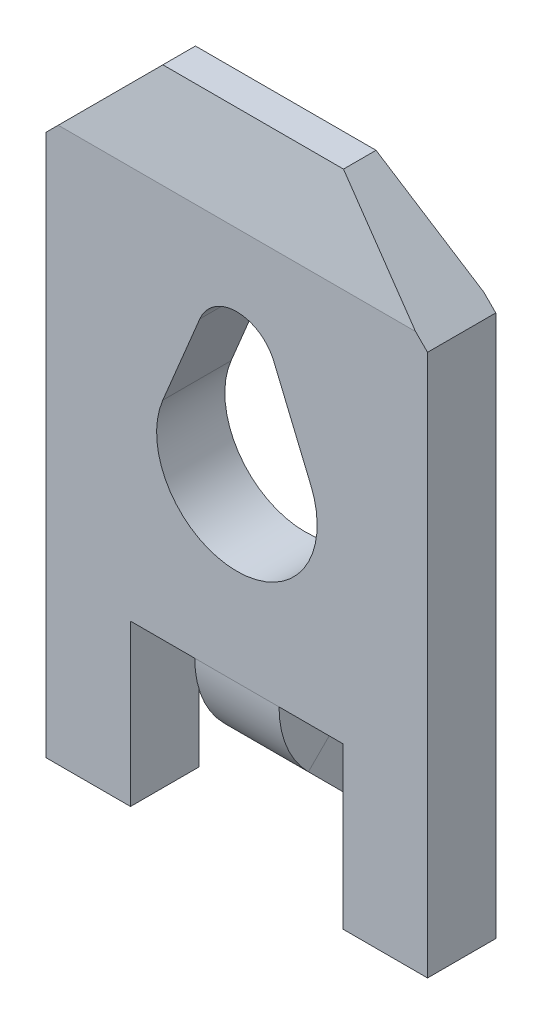
ISO-10303-21;
HEADER;
FILE_DESCRIPTION(('STEP AP214'),'2;1');
FILE_NAME('part.step','',(''),(''),'','','');
FILE_SCHEMA(('AUTOMOTIVE_DESIGN { 1 0 10303 214 1 1 1 1 }'));
ENDSEC;
DATA;
#1=APPLICATION_CONTEXT('core data for automotive mechanical design processes');
#2=APPLICATION_PROTOCOL_DEFINITION('international standard','automotive_design',2000,#1);
#3=PRODUCT_CONTEXT('',#1,'mechanical');
#4=PRODUCT('Part','Part','',(#3));
#5=PRODUCT_RELATED_PRODUCT_CATEGORY('part','',(#4));
#6=PRODUCT_DEFINITION_FORMATION('','',#4);
#7=PRODUCT_DEFINITION_CONTEXT('part definition',#1,'design');
#8=PRODUCT_DEFINITION('design','',#6,#7);
#9=PRODUCT_DEFINITION_SHAPE('','',#8);
#10=(LENGTH_UNIT() NAMED_UNIT(*) SI_UNIT(.MILLI.,.METRE.));
#11=(NAMED_UNIT(*) PLANE_ANGLE_UNIT() SI_UNIT($,.RADIAN.));
#12=(NAMED_UNIT(*) SI_UNIT($,.STERADIAN.) SOLID_ANGLE_UNIT());
#13=UNCERTAINTY_MEASURE_WITH_UNIT(LENGTH_MEASURE(1.E-05),#10,'distance_accuracy_value','');
#14=(GEOMETRIC_REPRESENTATION_CONTEXT(3) GLOBAL_UNCERTAINTY_ASSIGNED_CONTEXT((#13)) GLOBAL_UNIT_ASSIGNED_CONTEXT((#10,
#11,#12)) REPRESENTATION_CONTEXT('',''));
#15=CARTESIAN_POINT('',(0.,0.,0.));
#16=DIRECTION('',(0.,0.,1.));
#17=DIRECTION('',(1.,0.,0.));
#18=AXIS2_PLACEMENT_3D('',#15,#16,#17);
#19=CARTESIAN_POINT('',(4.75,0.149999999999999,0.));
#20=DIRECTION('',(0.,0.,1.));
#21=DIRECTION('',(0.,-1.,0.));
#22=AXIS2_PLACEMENT_3D('',#19,#20,#21);
#23=PLANE('',#22);
#24=DIRECTION('',(0.384813689288076,-0.922994271128754,0.));
#25=VECTOR('',#24,1.);
#26=CARTESIAN_POINT('',(2.84243697464802,5.82748992853653,0.));
#27=LINE('',#26,#25);
#28=CARTESIAN_POINT('',(2.84243697464802,5.82748992853653,0.));
#29=VERTEX_POINT('',#28);
#30=CARTESIAN_POINT('',(3.29799427112875,4.73481368928808,0.));
#31=VERTEX_POINT('',#30);
#32=EDGE_CURVE('E271',#29,#31,#27,.T.);
#33=ORIENTED_EDGE('',*,*,#32,.F.);
#34=CARTESIAN_POINT('',(2.375,5.65,0.));
#35=DIRECTION('',(0.,0.,1.));
#36=DIRECTION('',(0.,-1.,0.));
#37=AXIS2_PLACEMENT_3D('',#34,#35,#36);
#38=CIRCLE('',#37,0.5);
#39=CARTESIAN_POINT('',(1.91346153846154,5.84230769230769,0.));
#40=VERTEX_POINT('',#39);
#41=EDGE_CURVE('E274',#40,#29,#38,.F.);
#42=ORIENTED_EDGE('',*,*,#41,.F.);
#43=DIRECTION('',(0.384615384615385,0.923076923076923,0.));
#44=VECTOR('',#43,1.);
#45=CARTESIAN_POINT('',(1.91346153846154,5.84230769230769,0.));
#46=LINE('',#45,#44);
#47=CARTESIAN_POINT('',(1.45192307692308,4.73461538461538,0.));
#48=VERTEX_POINT('',#47);
#49=EDGE_CURVE('E276',#48,#40,#46,.T.);
#50=ORIENTED_EDGE('',*,*,#49,.F.);
#51=CARTESIAN_POINT('',(2.375,4.35,0.));
#52=DIRECTION('',(0.,0.,1.));
#53=DIRECTION('',(0.,-1.,0.));
#54=AXIS2_PLACEMENT_3D('',#51,#52,#53);
#55=CIRCLE('',#54,1.);
#56=EDGE_CURVE('E268',#31,#48,#55,.F.);
#57=ORIENTED_EDGE('',*,*,#56,.F.);
#58=EDGE_LOOP('',(#33,#42,#50,#57));
#59=FACE_BOUND('',#58,.T.);
#60=DIRECTION('',(1.,0.,0.));
#61=VECTOR('',#60,1.);
#62=CARTESIAN_POINT('',(2.9,2.15,0.));
#63=LINE('',#62,#61);
#64=CARTESIAN_POINT('',(2.9,2.15,0.));
#65=VERTEX_POINT('',#64);
#66=CARTESIAN_POINT('',(3.7,2.15,0.));
#67=VERTEX_POINT('',#66);
#68=EDGE_CURVE('E236',#65,#67,#63,.T.);
#69=ORIENTED_EDGE('',*,*,#68,.F.);
#70=DIRECTION('',(-1.,0.,0.));
#71=VECTOR('',#70,1.);
#72=CARTESIAN_POINT('',(4.75,2.15,0.));
#73=LINE('',#72,#71);
#74=CARTESIAN_POINT('',(1.85,2.15,0.));
#75=VERTEX_POINT('',#74);
#76=EDGE_CURVE('E49',#65,#75,#73,.T.);
#77=ORIENTED_EDGE('',*,*,#76,.T.);
#78=DIRECTION('',(1.,0.,0.));
#79=VECTOR('',#78,1.);
#80=CARTESIAN_POINT('',(1.85,2.15,0.));
#81=LINE('',#80,#79);
#82=CARTESIAN_POINT('',(1.05,2.15,0.));
#83=VERTEX_POINT('',#82);
#84=EDGE_CURVE('E247',#83,#75,#81,.T.);
#85=ORIENTED_EDGE('',*,*,#84,.F.);
#86=DIRECTION('',(0.,1.,0.));
#87=VECTOR('',#86,1.);
#88=CARTESIAN_POINT('',(1.05,2.15,0.));
#89=LINE('',#88,#87);
#90=CARTESIAN_POINT('',(1.05,0.149999999999999,0.));
#91=VERTEX_POINT('',#90);
#92=EDGE_CURVE('E245',#91,#83,#89,.T.);
#93=ORIENTED_EDGE('',*,*,#92,.F.);
#94=DIRECTION('',(-1.,0.,0.));
#95=VECTOR('',#94,1.);
#96=CARTESIAN_POINT('',(4.75,0.149999999999999,0.));
#97=LINE('',#96,#95);
#98=CARTESIAN_POINT('',(0.,0.149999999999999,0.));
#99=VERTEX_POINT('',#98);
#100=EDGE_CURVE('E345',#91,#99,#97,.T.);
#101=ORIENTED_EDGE('',*,*,#100,.T.);
#102=DIRECTION('',(0.,1.,0.));
#103=VECTOR('',#102,1.);
#104=CARTESIAN_POINT('',(0.,0.149999999999999,0.));
#105=LINE('',#104,#103);
#106=CARTESIAN_POINT('',(0.,6.9,0.));
#107=VERTEX_POINT('',#106);
#108=EDGE_CURVE('E330',#99,#107,#105,.T.);
#109=ORIENTED_EDGE('',*,*,#108,.T.);
#110=DIRECTION('',(-0.707106781186548,-0.707106781186548,0.));
#111=VECTOR('',#110,1.);
#112=CARTESIAN_POINT('',(0.,6.9,0.));
#113=LINE('',#112,#111);
#114=CARTESIAN_POINT('',(0.15,7.05,0.));
#115=VERTEX_POINT('',#114);
#116=EDGE_CURVE('E304',#115,#107,#113,.T.);
#117=ORIENTED_EDGE('',*,*,#116,.F.);
#118=DIRECTION('',(-1.,0.,0.));
#119=VECTOR('',#118,1.);
#120=CARTESIAN_POINT('',(4.75,7.05,0.));
#121=LINE('',#120,#119);
#122=CARTESIAN_POINT('',(4.6,7.05,0.));
#123=VERTEX_POINT('',#122);
#124=EDGE_CURVE('E335',#123,#115,#121,.T.);
#125=ORIENTED_EDGE('',*,*,#124,.F.);
#126=DIRECTION('',(-0.707106781186548,0.707106781186548,0.));
#127=VECTOR('',#126,1.);
#128=CARTESIAN_POINT('',(3.5,8.15,0.));
#129=LINE('',#128,#127);
#130=CARTESIAN_POINT('',(4.75,6.9,0.));
#131=VERTEX_POINT('',#130);
#132=EDGE_CURVE('E300',#131,#123,#129,.T.);
#133=ORIENTED_EDGE('',*,*,#132,.F.);
#134=DIRECTION('',(0.,1.,0.));
#135=VECTOR('',#134,1.);
#136=CARTESIAN_POINT('',(4.75,0.149999999999999,0.));
#137=LINE('',#136,#135);
#138=CARTESIAN_POINT('',(4.75,0.149999999999999,0.));
#139=VERTEX_POINT('',#138);
#140=EDGE_CURVE('E332',#139,#131,#137,.T.);
#141=ORIENTED_EDGE('',*,*,#140,.F.);
#142=CARTESIAN_POINT('',(3.7,0.149999999999999,0.));
#143=VERTEX_POINT('',#142);
#144=EDGE_CURVE('E346',#139,#143,#97,.T.);
#145=ORIENTED_EDGE('',*,*,#144,.T.);
#146=DIRECTION('',(0.,-1.,0.));
#147=VECTOR('',#146,1.);
#148=CARTESIAN_POINT('',(3.7,2.15,0.));
#149=LINE('',#148,#147);
#150=EDGE_CURVE('E260',#67,#143,#149,.T.);
#151=ORIENTED_EDGE('',*,*,#150,.F.);
#152=EDGE_LOOP('',(#69,#77,#85,#93,#101,#109,#117,#125,#133,#141,#145,#151));
#153=FACE_BOUND('',#152,.T.);
#154=ADVANCED_FACE('F42',(#59,#153),#23,.F.);
#155=CARTESIAN_POINT('',(4.75,7.05,0.85));
#156=DIRECTION('',(0.,0.,-1.));
#157=DIRECTION('',(0.,1.,0.));
#158=AXIS2_PLACEMENT_3D('',#155,#156,#157);
#159=PLANE('',#158);
#160=DIRECTION('',(-0.384615384615385,-0.923076923076923,0.));
#161=VECTOR('',#160,1.);
#162=CARTESIAN_POINT('',(1.91346153846154,5.84230769230769,0.849999999999999));
#163=LINE('',#162,#161);
#164=CARTESIAN_POINT('',(1.91346153846154,5.84230769230769,0.85));
#165=VERTEX_POINT('',#164);
#166=CARTESIAN_POINT('',(1.45192307692308,4.73461538461538,0.849999999999999));
#167=VERTEX_POINT('',#166);
#168=EDGE_CURVE('E278',#165,#167,#163,.T.);
#169=ORIENTED_EDGE('',*,*,#168,.F.);
#170=CARTESIAN_POINT('',(2.375,5.65,0.849999999999999));
#171=DIRECTION('',(0.,0.,1.));
#172=DIRECTION('',(1.,0.,0.));
#173=AXIS2_PLACEMENT_3D('',#170,#171,#172);
#174=CIRCLE('',#173,0.5);
#175=CARTESIAN_POINT('',(2.84243697464802,5.82748992853653,0.849999999999999));
#176=VERTEX_POINT('',#175);
#177=EDGE_CURVE('E254',#176,#165,#174,.T.);
#178=ORIENTED_EDGE('',*,*,#177,.F.);
#179=DIRECTION('',(-0.384813689288076,0.922994271128754,0.));
#180=VECTOR('',#179,1.);
#181=CARTESIAN_POINT('',(2.84243697464802,5.82748992853653,0.849999999999999));
#182=LINE('',#181,#180);
#183=CARTESIAN_POINT('',(3.29799427112875,4.73481368928808,0.849999999999999));
#184=VERTEX_POINT('',#183);
#185=EDGE_CURVE('E284',#184,#176,#182,.T.);
#186=ORIENTED_EDGE('',*,*,#185,.F.);
#187=CARTESIAN_POINT('',(2.375,4.35,0.849999999999999));
#188=DIRECTION('',(0.,0.,1.));
#189=DIRECTION('',(1.,0.,0.));
#190=AXIS2_PLACEMENT_3D('',#187,#188,#189);
#191=CIRCLE('',#190,1.);
#192=EDGE_CURVE('E281',#167,#184,#191,.T.);
#193=ORIENTED_EDGE('',*,*,#192,.F.);
#194=EDGE_LOOP('',(#169,#178,#186,#193));
#195=FACE_BOUND('',#194,.T.);
#196=DIRECTION('',(-1.,0.,0.));
#197=VECTOR('',#196,1.);
#198=CARTESIAN_POINT('',(1.85,2.15,0.85));
#199=LINE('',#198,#197);
#200=CARTESIAN_POINT('',(1.85,2.15,0.85));
#201=VERTEX_POINT('',#200);
#202=CARTESIAN_POINT('',(1.05,2.15,0.85));
#203=VERTEX_POINT('',#202);
#204=EDGE_CURVE('E241',#201,#203,#199,.T.);
#205=ORIENTED_EDGE('',*,*,#204,.F.);
#206=DIRECTION('',(1.,0.,0.));
#207=VECTOR('',#206,1.);
#208=CARTESIAN_POINT('',(4.75,2.15,0.849999999999999));
#209=LINE('',#208,#207);
#210=CARTESIAN_POINT('',(2.9,2.15,0.849999999999999));
#211=VERTEX_POINT('',#210);
#212=EDGE_CURVE('E362',#201,#211,#209,.T.);
#213=ORIENTED_EDGE('',*,*,#212,.T.);
#214=DIRECTION('',(-1.,0.,0.));
#215=VECTOR('',#214,1.);
#216=CARTESIAN_POINT('',(2.9,2.15,0.85));
#217=LINE('',#216,#215);
#218=CARTESIAN_POINT('',(3.7,2.15,0.85));
#219=VERTEX_POINT('',#218);
#220=EDGE_CURVE('E248',#219,#211,#217,.T.);
#221=ORIENTED_EDGE('',*,*,#220,.F.);
#222=DIRECTION('',(0.,1.,0.));
#223=VECTOR('',#222,1.);
#224=CARTESIAN_POINT('',(3.7,2.15,0.85));
#225=LINE('',#224,#223);
#226=CARTESIAN_POINT('',(3.7,0.149999999999999,0.849999999999999));
#227=VERTEX_POINT('',#226);
#228=EDGE_CURVE('E255',#227,#219,#225,.T.);
#229=ORIENTED_EDGE('',*,*,#228,.F.);
#230=DIRECTION('',(-1.,0.,0.));
#231=VECTOR('',#230,1.);
#232=CARTESIAN_POINT('',(4.75,0.149999999999999,0.849999999999999));
#233=LINE('',#232,#231);
#234=CARTESIAN_POINT('',(4.75,0.149999999999999,0.849999999999999));
#235=VERTEX_POINT('',#234);
#236=EDGE_CURVE('E350',#235,#227,#233,.T.);
#237=ORIENTED_EDGE('',*,*,#236,.F.);
#238=DIRECTION('',(0.,-1.,0.));
#239=VECTOR('',#238,1.);
#240=CARTESIAN_POINT('',(4.75,7.05,0.85));
#241=LINE('',#240,#239);
#242=CARTESIAN_POINT('',(4.75,6.9,0.85));
#243=VERTEX_POINT('',#242);
#244=EDGE_CURVE('E327',#243,#235,#241,.T.);
#245=ORIENTED_EDGE('',*,*,#244,.F.);
#246=DIRECTION('',(0.707106781186548,-0.707106781186548,0.));
#247=VECTOR('',#246,1.);
#248=CARTESIAN_POINT('',(3.5,8.15,0.849999999999999));
#249=LINE('',#248,#247);
#250=CARTESIAN_POINT('',(4.6,7.05,0.849999999999999));
#251=VERTEX_POINT('',#250);
#252=EDGE_CURVE('E296',#251,#243,#249,.T.);
#253=ORIENTED_EDGE('',*,*,#252,.F.);
#254=DIRECTION('',(-1.,0.,0.));
#255=VECTOR('',#254,1.);
#256=CARTESIAN_POINT('',(4.75,7.05,0.85));
#257=LINE('',#256,#255);
#258=CARTESIAN_POINT('',(0.15,7.05,0.849999999999999));
#259=VERTEX_POINT('',#258);
#260=EDGE_CURVE('E353',#251,#259,#257,.T.);
#261=ORIENTED_EDGE('',*,*,#260,.T.);
#262=DIRECTION('',(0.707106781186547,0.707106781186548,0.));
#263=VECTOR('',#262,1.);
#264=CARTESIAN_POINT('',(0.,6.9,0.849999999999999));
#265=LINE('',#264,#263);
#266=CARTESIAN_POINT('',(0.,6.9,0.849999999999999));
#267=VERTEX_POINT('',#266);
#268=EDGE_CURVE('E297',#267,#259,#265,.T.);
#269=ORIENTED_EDGE('',*,*,#268,.F.);
#270=DIRECTION('',(0.,-1.,0.));
#271=VECTOR('',#270,1.);
#272=CARTESIAN_POINT('',(0.,7.05,0.85));
#273=LINE('',#272,#271);
#274=CARTESIAN_POINT('',(0.,0.149999999999999,0.849999999999999));
#275=VERTEX_POINT('',#274);
#276=EDGE_CURVE('E326',#267,#275,#273,.T.);
#277=ORIENTED_EDGE('',*,*,#276,.T.);
#278=CARTESIAN_POINT('',(1.05,0.149999999999999,0.849999999999999));
#279=VERTEX_POINT('',#278);
#280=EDGE_CURVE('E349',#279,#275,#233,.T.);
#281=ORIENTED_EDGE('',*,*,#280,.F.);
#282=DIRECTION('',(0.,-1.,0.));
#283=VECTOR('',#282,1.);
#284=CARTESIAN_POINT('',(1.05,2.15,0.85));
#285=LINE('',#284,#283);
#286=EDGE_CURVE('E243',#203,#279,#285,.T.);
#287=ORIENTED_EDGE('',*,*,#286,.F.);
#288=EDGE_LOOP('',(#205,#213,#221,#229,#237,#245,#253,#261,#269,#277,#281,#287));
#289=FACE_BOUND('',#288,.T.);
#290=ADVANCED_FACE('F382',(#195,#289),#159,.F.);
#291=CARTESIAN_POINT('',(4.75,0.149999999999999,0.));
#292=DIRECTION('',(0.,1.,0.));
#293=DIRECTION('',(0.,0.,1.));
#294=AXIS2_PLACEMENT_3D('',#291,#292,#293);
#295=PLANE('',#294);
#296=ORIENTED_EDGE('',*,*,#100,.F.);
#297=DIRECTION('',(0.,0.,-1.));
#298=VECTOR('',#297,1.);
#299=CARTESIAN_POINT('',(1.05,0.149999999999999,3.0040659228538));
#300=LINE('',#299,#298);
#301=EDGE_CURVE('E63',#279,#91,#300,.T.);
#302=ORIENTED_EDGE('',*,*,#301,.F.);
#303=ORIENTED_EDGE('',*,*,#280,.T.);
#304=DIRECTION('',(0.,0.,-1.));
#305=VECTOR('',#304,1.);
#306=CARTESIAN_POINT('',(0.,0.149999999999999,0.));
#307=LINE('',#306,#305);
#308=EDGE_CURVE('E338',#275,#99,#307,.T.);
#309=ORIENTED_EDGE('',*,*,#308,.T.);
#310=EDGE_LOOP('',(#296,#302,#303,#309));
#311=FACE_BOUND('',#310,.T.);
#312=ADVANCED_FACE('F417',(#311),#295,.F.);
#313=CARTESIAN_POINT('',(4.75,7.05,0.));
#314=DIRECTION('',(0.,-0.214348018272916,0.976757353216485));
#315=DIRECTION('',(0.,-0.976757353216485,-0.214348018272916));
#316=AXIS2_PLACEMENT_3D('',#313,#314,#315);
#317=PLANE('',#316);
#318=ORIENTED_EDGE('',*,*,#124,.T.);
#319=DIRECTION('',(0.698744344369524,0.698744344369524,0.153338457091523));
#320=VECTOR('',#319,1.);
#321=CARTESIAN_POINT('',(2.39592083042662,9.29592083042662,0.492864146468432));
#322=LINE('',#321,#320);
#323=CARTESIAN_POINT('',(1.25,8.15,0.241393442622949));
#324=VERTEX_POINT('',#323);
#325=EDGE_CURVE('E317',#115,#324,#322,.T.);
#326=ORIENTED_EDGE('',*,*,#325,.T.);
#327=DIRECTION('',(-1.,0.,0.));
#328=VECTOR('',#327,1.);
#329=CARTESIAN_POINT('',(4.75,8.15,0.241393442622949));
#330=LINE('',#329,#328);
#331=CARTESIAN_POINT('',(3.5,8.15,0.241393442622949));
#332=VERTEX_POINT('',#331);
#333=EDGE_CURVE('E359',#332,#324,#330,.T.);
#334=ORIENTED_EDGE('',*,*,#333,.F.);
#335=DIRECTION('',(0.698744344369524,-0.698744344369524,-0.153338457091523));
#336=VECTOR('',#335,1.);
#337=CARTESIAN_POINT('',(4.67323654881826,6.97676345118174,-0.0160716569500576));
#338=LINE('',#337,#336);
#339=EDGE_CURVE('E323',#332,#123,#338,.T.);
#340=ORIENTED_EDGE('',*,*,#339,.T.);
#341=EDGE_LOOP('',(#318,#326,#334,#340));
#342=FACE_BOUND('',#341,.T.);
#343=ADVANCED_FACE('F479',(#342),#317,.F.);
#344=CARTESIAN_POINT('',(4.75,8.15,0.241393442622949));
#345=DIRECTION('',(0.,-1.,0.));
#346=DIRECTION('',(0.,0.,-1.));
#347=AXIS2_PLACEMENT_3D('',#344,#345,#346);
#348=PLANE('',#347);
#349=ORIENTED_EDGE('',*,*,#333,.T.);
#350=DIRECTION('',(0.,0.,1.));
#351=VECTOR('',#350,1.);
#352=CARTESIAN_POINT('',(1.25,8.15,-1.76776695296637));
#353=LINE('',#352,#351);
#354=CARTESIAN_POINT('',(1.25,8.15,0.647131147540979));
#355=VERTEX_POINT('',#354);
#356=EDGE_CURVE('E301',#324,#355,#353,.T.);
#357=ORIENTED_EDGE('',*,*,#356,.T.);
#358=DIRECTION('',(-1.,0.,0.));
#359=VECTOR('',#358,1.);
#360=CARTESIAN_POINT('',(4.75,8.15,0.647131147540979));
#361=LINE('',#360,#359);
#362=CARTESIAN_POINT('',(3.5,8.15,0.647131147540979));
#363=VERTEX_POINT('',#362);
#364=EDGE_CURVE('E356',#363,#355,#361,.T.);
#365=ORIENTED_EDGE('',*,*,#364,.F.);
#366=DIRECTION('',(0.,0.,1.));
#367=VECTOR('',#366,1.);
#368=CARTESIAN_POINT('',(3.5,8.15,-1.76776695296637));
#369=LINE('',#368,#367);
#370=EDGE_CURVE('E309',#332,#363,#369,.T.);
#371=ORIENTED_EDGE('',*,*,#370,.F.);
#372=EDGE_LOOP('',(#349,#357,#365,#371));
#373=FACE_BOUND('',#372,.T.);
#374=ADVANCED_FACE('F475',(#373),#348,.F.);
#375=CARTESIAN_POINT('',(4.75,8.15,0.647131147540979));
#376=DIRECTION('',(0.,-0.181367589437408,-0.983415373838371));
#377=DIRECTION('',(0.,0.983415373838371,-0.181367589437408));
#378=AXIS2_PLACEMENT_3D('',#375,#376,#377);
#379=PLANE('',#378);
#380=ORIENTED_EDGE('',*,*,#364,.T.);
#381=DIRECTION('',(-0.70116968993079,-0.70116968993079,0.12931408215937));
#382=VECTOR('',#381,1.);
#383=CARTESIAN_POINT('',(2.97073626927174,9.87073626927174,0.329782245421185));
#384=LINE('',#383,#382);
#385=EDGE_CURVE('E307',#355,#259,#384,.T.);
#386=ORIENTED_EDGE('',*,*,#385,.T.);
#387=ORIENTED_EDGE('',*,*,#260,.F.);
#388=DIRECTION('',(-0.70116968993079,0.70116968993079,-0.12931408215937));
#389=VECTOR('',#388,1.);
#390=CARTESIAN_POINT('',(4.11454866759705,7.53545133240295,0.760470041155192));
#391=LINE('',#390,#389);
#392=EDGE_CURVE('E320',#251,#363,#391,.T.);
#393=ORIENTED_EDGE('',*,*,#392,.T.);
#394=EDGE_LOOP('',(#380,#386,#387,#393));
#395=FACE_BOUND('',#394,.T.);
#396=ADVANCED_FACE('F471',(#395),#379,.F.);
#397=ORIENTED_EDGE('',*,*,#236,.T.);
#398=DIRECTION('',(0.,0.,-1.));
#399=VECTOR('',#398,1.);
#400=CARTESIAN_POINT('',(3.7,0.149999999999999,3.0040659228538));
#401=LINE('',#400,#399);
#402=EDGE_CURVE('E257',#227,#143,#401,.T.);
#403=ORIENTED_EDGE('',*,*,#402,.T.);
#404=ORIENTED_EDGE('',*,*,#144,.F.);
#405=DIRECTION('',(0.,0.,-1.));
#406=VECTOR('',#405,1.);
#407=CARTESIAN_POINT('',(4.75,0.149999999999999,0.));
#408=LINE('',#407,#406);
#409=EDGE_CURVE('E329',#235,#139,#408,.T.);
#410=ORIENTED_EDGE('',*,*,#409,.F.);
#411=EDGE_LOOP('',(#397,#403,#404,#410));
#412=FACE_BOUND('',#411,.T.);
#413=ADVANCED_FACE('F464',(#412),#295,.F.);
#414=CARTESIAN_POINT('',(4.75,0.,0.));
#415=DIRECTION('',(1.,0.,0.));
#416=DIRECTION('',(0.,0.,-1.));
#417=AXIS2_PLACEMENT_3D('',#414,#415,#416);
#418=PLANE('',#417);
#419=DIRECTION('',(0.,0.,1.));
#420=VECTOR('',#419,1.);
#421=CARTESIAN_POINT('',(4.75,6.9,-1.76776695296637));
#422=LINE('',#421,#420);
#423=EDGE_CURVE('E310',#131,#243,#422,.T.);
#424=ORIENTED_EDGE('',*,*,#423,.T.);
#425=ORIENTED_EDGE('',*,*,#244,.T.);
#426=ORIENTED_EDGE('',*,*,#409,.T.);
#427=ORIENTED_EDGE('',*,*,#140,.T.);
#428=EDGE_LOOP('',(#424,#425,#426,#427));
#429=FACE_BOUND('',#428,.T.);
#430=ADVANCED_FACE('F461',(#429),#418,.T.);
#431=CARTESIAN_POINT('',(0.,0.,0.));
#432=DIRECTION('',(1.,0.,0.));
#433=DIRECTION('',(0.,0.,-1.));
#434=AXIS2_PLACEMENT_3D('',#431,#432,#433);
#435=PLANE('',#434);
#436=ORIENTED_EDGE('',*,*,#276,.F.);
#437=DIRECTION('',(0.,0.,1.));
#438=VECTOR('',#437,1.);
#439=CARTESIAN_POINT('',(0.,6.9,-1.76776695296637));
#440=LINE('',#439,#438);
#441=EDGE_CURVE('E299',#107,#267,#440,.T.);
#442=ORIENTED_EDGE('',*,*,#441,.F.);
#443=ORIENTED_EDGE('',*,*,#108,.F.);
#444=ORIENTED_EDGE('',*,*,#308,.F.);
#445=EDGE_LOOP('',(#436,#442,#443,#444));
#446=FACE_BOUND('',#445,.T.);
#447=ADVANCED_FACE('F456',(#446),#435,.F.);
#448=CARTESIAN_POINT('',(0.,6.9,-1.76776695296637));
#449=DIRECTION('',(0.707106781186548,-0.707106781186548,0.));
#450=DIRECTION('',(0.707106781186548,0.707106781186548,0.));
#451=AXIS2_PLACEMENT_3D('',#448,#449,#450);
#452=PLANE('',#451);
#453=ORIENTED_EDGE('',*,*,#116,.T.);
#454=ORIENTED_EDGE('',*,*,#441,.T.);
#455=ORIENTED_EDGE('',*,*,#268,.T.);
#456=ORIENTED_EDGE('',*,*,#385,.F.);
#457=ORIENTED_EDGE('',*,*,#356,.F.);
#458=ORIENTED_EDGE('',*,*,#325,.F.);
#459=EDGE_LOOP('',(#453,#454,#455,#456,#457,#458));
#460=FACE_BOUND('',#459,.T.);
#461=ADVANCED_FACE('F453',(#460),#452,.F.);
#462=CARTESIAN_POINT('',(3.5,8.15,-1.76776695296637));
#463=DIRECTION('',(-0.707106781186547,-0.707106781186547,0.));
#464=DIRECTION('',(0.707106781186548,-0.707106781186548,0.));
#465=AXIS2_PLACEMENT_3D('',#462,#463,#464);
#466=PLANE('',#465);
#467=ORIENTED_EDGE('',*,*,#370,.T.);
#468=ORIENTED_EDGE('',*,*,#392,.F.);
#469=ORIENTED_EDGE('',*,*,#252,.T.);
#470=ORIENTED_EDGE('',*,*,#423,.F.);
#471=ORIENTED_EDGE('',*,*,#132,.T.);
#472=ORIENTED_EDGE('',*,*,#339,.F.);
#473=EDGE_LOOP('',(#467,#468,#469,#470,#471,#472));
#474=FACE_BOUND('',#473,.T.);
#475=ADVANCED_FACE('F452',(#474),#466,.F.);
#476=CARTESIAN_POINT('',(2.375,5.65,-3.44093010681705));
#477=DIRECTION('',(0.,0.,1.));
#478=DIRECTION('',(1.,0.,0.));
#479=AXIS2_PLACEMENT_3D('',#476,#477,#478);
#480=CYLINDRICAL_SURFACE('',#479,0.5);
#481=ORIENTED_EDGE('',*,*,#41,.T.);
#482=DIRECTION('',(0.,0.,1.));
#483=VECTOR('',#482,1.);
#484=CARTESIAN_POINT('',(2.84243697464802,5.82748992853653,-3.44093010681705));
#485=LINE('',#484,#483);
#486=EDGE_CURVE('E272',#29,#176,#485,.T.);
#487=ORIENTED_EDGE('',*,*,#486,.T.);
#488=ORIENTED_EDGE('',*,*,#177,.T.);
#489=DIRECTION('',(0.,0.,1.));
#490=VECTOR('',#489,1.);
#491=CARTESIAN_POINT('',(1.91346153846154,5.84230769230769,-3.44093010681705));
#492=LINE('',#491,#490);
#493=EDGE_CURVE('E287',#40,#165,#492,.T.);
#494=ORIENTED_EDGE('',*,*,#493,.F.);
#495=EDGE_LOOP('',(#481,#487,#488,#494));
#496=FACE_BOUND('',#495,.T.);
#497=ADVANCED_FACE('F435',(#496),#480,.F.);
#498=CARTESIAN_POINT('',(2.84243697464802,5.82748992853653,-3.44093010681705));
#499=DIRECTION('',(0.922994271128754,0.384813689288076,0.));
#500=DIRECTION('',(-0.384813689288076,0.922994271128754,0.));
#501=AXIS2_PLACEMENT_3D('',#498,#499,#500);
#502=PLANE('',#501);
#503=ORIENTED_EDGE('',*,*,#32,.T.);
#504=DIRECTION('',(0.,0.,1.));
#505=VECTOR('',#504,1.);
#506=CARTESIAN_POINT('',(3.29799427112875,4.73481368928808,-3.44093010681705));
#507=LINE('',#506,#505);
#508=EDGE_CURVE('E289',#31,#184,#507,.T.);
#509=ORIENTED_EDGE('',*,*,#508,.T.);
#510=ORIENTED_EDGE('',*,*,#185,.T.);
#511=ORIENTED_EDGE('',*,*,#486,.F.);
#512=EDGE_LOOP('',(#503,#509,#510,#511));
#513=FACE_BOUND('',#512,.T.);
#514=ADVANCED_FACE('F426',(#513),#502,.F.);
#515=CARTESIAN_POINT('',(2.375,4.35,-3.44093010681705));
#516=DIRECTION('',(0.,0.,1.));
#517=DIRECTION('',(1.,0.,0.));
#518=AXIS2_PLACEMENT_3D('',#515,#516,#517);
#519=CYLINDRICAL_SURFACE('',#518,1.);
#520=ORIENTED_EDGE('',*,*,#56,.T.);
#521=DIRECTION('',(0.,0.,1.));
#522=VECTOR('',#521,1.);
#523=CARTESIAN_POINT('',(1.45192307692308,4.73461538461538,-3.44093010681705));
#524=LINE('',#523,#522);
#525=EDGE_CURVE('E291',#48,#167,#524,.T.);
#526=ORIENTED_EDGE('',*,*,#525,.T.);
#527=ORIENTED_EDGE('',*,*,#192,.T.);
#528=ORIENTED_EDGE('',*,*,#508,.F.);
#529=EDGE_LOOP('',(#520,#526,#527,#528));
#530=FACE_BOUND('',#529,.T.);
#531=ADVANCED_FACE('F428',(#530),#519,.F.);
#532=CARTESIAN_POINT('',(1.91346153846154,5.84230769230769,-3.44093010681705));
#533=DIRECTION('',(-0.923076923076923,0.384615384615385,0.));
#534=DIRECTION('',(-0.384615384615385,-0.923076923076923,0.));
#535=AXIS2_PLACEMENT_3D('',#532,#533,#534);
#536=PLANE('',#535);
#537=ORIENTED_EDGE('',*,*,#49,.T.);
#538=ORIENTED_EDGE('',*,*,#493,.T.);
#539=ORIENTED_EDGE('',*,*,#168,.T.);
#540=ORIENTED_EDGE('',*,*,#525,.F.);
#541=EDGE_LOOP('',(#537,#538,#539,#540));
#542=FACE_BOUND('',#541,.T.);
#543=ADVANCED_FACE('F437',(#542),#536,.F.);
#544=CARTESIAN_POINT('',(3.7,2.15,3.0040659228538));
#545=DIRECTION('',(1.,0.,0.));
#546=DIRECTION('',(0.,1.,0.));
#547=AXIS2_PLACEMENT_3D('',#544,#545,#546);
#548=PLANE('',#547);
#549=ORIENTED_EDGE('',*,*,#228,.T.);
#550=DIRECTION('',(0.,0.,-1.));
#551=VECTOR('',#550,1.);
#552=CARTESIAN_POINT('',(3.7,2.15,3.0040659228538));
#553=LINE('',#552,#551);
#554=EDGE_CURVE('E262',#219,#67,#553,.T.);
#555=ORIENTED_EDGE('',*,*,#554,.T.);
#556=ORIENTED_EDGE('',*,*,#150,.T.);
#557=ORIENTED_EDGE('',*,*,#402,.F.);
#558=EDGE_LOOP('',(#549,#555,#556,#557));
#559=FACE_BOUND('',#558,.T.);
#560=ADVANCED_FACE('F439',(#559),#548,.F.);
#561=CARTESIAN_POINT('',(2.9,2.15,3.0040659228538));
#562=DIRECTION('',(0.,1.,0.));
#563=DIRECTION('',(-1.,0.,0.));
#564=AXIS2_PLACEMENT_3D('',#561,#562,#563);
#565=PLANE('',#564);
#566=ORIENTED_EDGE('',*,*,#220,.T.);
#567=DIRECTION('',(0.,0.,-1.));
#568=VECTOR('',#567,1.);
#569=CARTESIAN_POINT('',(2.9,2.15,3.0040659228538));
#570=LINE('',#569,#568);
#571=EDGE_CURVE('E12',#211,#65,#570,.T.);
#572=ORIENTED_EDGE('',*,*,#571,.T.);
#573=ORIENTED_EDGE('',*,*,#68,.T.);
#574=ORIENTED_EDGE('',*,*,#554,.F.);
#575=EDGE_LOOP('',(#566,#572,#573,#574));
#576=FACE_BOUND('',#575,.T.);
#577=ADVANCED_FACE('F372',(#576),#565,.F.);
#578=CARTESIAN_POINT('',(1.85,2.15,3.0040659228538));
#579=DIRECTION('',(0.,1.,0.));
#580=DIRECTION('',(0.,0.,1.));
#581=AXIS2_PLACEMENT_3D('',#578,#579,#580);
#582=PLANE('',#581);
#583=ORIENTED_EDGE('',*,*,#204,.T.);
#584=DIRECTION('',(0.,0.,-1.));
#585=VECTOR('',#584,1.);
#586=CARTESIAN_POINT('',(1.05,2.15,3.0040659228538));
#587=LINE('',#586,#585);
#588=EDGE_CURVE('E244',#203,#83,#587,.T.);
#589=ORIENTED_EDGE('',*,*,#588,.T.);
#590=ORIENTED_EDGE('',*,*,#84,.T.);
#591=DIRECTION('',(0.,0.,-1.));
#592=VECTOR('',#591,1.);
#593=CARTESIAN_POINT('',(1.85,2.15,3.0040659228538));
#594=LINE('',#593,#592);
#595=EDGE_CURVE('E365',#201,#75,#594,.T.);
#596=ORIENTED_EDGE('',*,*,#595,.F.);
#597=EDGE_LOOP('',(#583,#589,#590,#596));
#598=FACE_BOUND('',#597,.T.);
#599=ADVANCED_FACE('F389',(#598),#582,.F.);
#600=CARTESIAN_POINT('',(1.05,2.15,3.0040659228538));
#601=DIRECTION('',(-1.,0.,0.));
#602=DIRECTION('',(0.,-1.,0.));
#603=AXIS2_PLACEMENT_3D('',#600,#601,#602);
#604=PLANE('',#603);
#605=ORIENTED_EDGE('',*,*,#286,.T.);
#606=ORIENTED_EDGE('',*,*,#301,.T.);
#607=ORIENTED_EDGE('',*,*,#92,.T.);
#608=ORIENTED_EDGE('',*,*,#588,.F.);
#609=EDGE_LOOP('',(#605,#606,#607,#608));
#610=FACE_BOUND('',#609,.T.);
#611=ADVANCED_FACE('F506',(#610),#604,.F.);
#612=CARTESIAN_POINT('',(1.85,2.15,-0.400000000000001));
#613=DIRECTION('',(-1.,0.,0.));
#614=DIRECTION('',(0.,0.,1.));
#615=AXIS2_PLACEMENT_3D('',#612,#613,#614);
#616=PLANE('',#615);
#617=ORIENTED_EDGE('',*,*,#595,.T.);
#618=CARTESIAN_POINT('',(1.85,2.15,-0.400000000000001));
#619=DIRECTION('',(1.,0.,0.));
#620=DIRECTION('',(0.,1.,0.));
#621=AXIS2_PLACEMENT_3D('',#618,#619,#620);
#622=CIRCLE('',#621,0.4);
#623=CARTESIAN_POINT('',(1.85,1.86715728752538,-0.117157287525382));
#624=VERTEX_POINT('',#623);
#625=EDGE_CURVE('E238',#75,#624,#622,.T.);
#626=ORIENTED_EDGE('',*,*,#625,.T.);
#627=DIRECTION('',(0.,-0.707106781186554,0.707106781186541));
#628=VECTOR('',#627,1.);
#629=CARTESIAN_POINT('',(1.85,-0.257038097655978,2.00703809765595));
#630=LINE('',#629,#628);
#631=CARTESIAN_POINT('',(1.85,1.26611652351682,0.483883476483182));
#632=VERTEX_POINT('',#631);
#633=EDGE_CURVE('E217',#624,#632,#630,.T.);
#634=ORIENTED_EDGE('',*,*,#633,.T.);
#635=CARTESIAN_POINT('',(1.85,2.15,-0.400000000000001));
#636=DIRECTION('',(1.,0.,0.));
#637=DIRECTION('',(0.,0.,1.));
#638=AXIS2_PLACEMENT_3D('',#635,#636,#637);
#639=CIRCLE('',#638,1.25);
#640=EDGE_CURVE('E229',#201,#632,#639,.T.);
#641=ORIENTED_EDGE('',*,*,#640,.F.);
#642=EDGE_LOOP('',(#617,#626,#634,#641));
#643=FACE_BOUND('',#642,.T.);
#644=ADVANCED_FACE('F391',(#643),#616,.T.);
#645=CARTESIAN_POINT('',(2.9,2.15,-0.400000000000001));
#646=DIRECTION('',(1.,0.,0.));
#647=DIRECTION('',(0.,0.,-1.));
#648=AXIS2_PLACEMENT_3D('',#645,#646,#647);
#649=PLANE('',#648);
#650=DIRECTION('',(0.,0.707106781186554,-0.707106781186541));
#651=VECTOR('',#650,1.);
#652=CARTESIAN_POINT('',(2.9,-0.257038097655979,2.00703809765595));
#653=LINE('',#652,#651);
#654=CARTESIAN_POINT('',(2.9,1.26611652351682,0.483883476483185));
#655=VERTEX_POINT('',#654);
#656=CARTESIAN_POINT('',(2.9,1.86715728752538,-0.117157287525382));
#657=VERTEX_POINT('',#656);
#658=EDGE_CURVE('E198',#655,#657,#653,.T.);
#659=ORIENTED_EDGE('',*,*,#658,.T.);
#660=CARTESIAN_POINT('',(2.9,2.15,-0.400000000000001));
#661=DIRECTION('',(1.,0.,0.));
#662=DIRECTION('',(0.,1.,0.));
#663=AXIS2_PLACEMENT_3D('',#660,#661,#662);
#664=CIRCLE('',#663,0.4);
#665=EDGE_CURVE('E233',#657,#65,#664,.F.);
#666=ORIENTED_EDGE('',*,*,#665,.T.);
#667=ORIENTED_EDGE('',*,*,#571,.F.);
#668=CARTESIAN_POINT('',(2.9,2.15,-0.400000000000001));
#669=DIRECTION('',(-1.,0.,0.));
#670=DIRECTION('',(0.,0.,-1.));
#671=AXIS2_PLACEMENT_3D('',#668,#669,#670);
#672=CIRCLE('',#671,1.25);
#673=EDGE_CURVE('E232',#655,#211,#672,.T.);
#674=ORIENTED_EDGE('',*,*,#673,.F.);
#675=EDGE_LOOP('',(#659,#666,#667,#674));
#676=FACE_BOUND('',#675,.T.);
#677=ADVANCED_FACE('F376',(#676),#649,.T.);
#678=CARTESIAN_POINT('',(0.876719746353102,2.15,-0.400000000000001));
#679=DIRECTION('',(1.,0.,0.));
#680=DIRECTION('',(0.,1.,0.));
#681=AXIS2_PLACEMENT_3D('',#678,#679,#680);
#682=CYLINDRICAL_SURFACE('',#681,1.25);
#683=ORIENTED_EDGE('',*,*,#673,.T.);
#684=ORIENTED_EDGE('',*,*,#212,.F.);
#685=ORIENTED_EDGE('',*,*,#640,.T.);
#686=DIRECTION('',(1.,0.,0.));
#687=VECTOR('',#686,1.);
#688=CARTESIAN_POINT('',(4.75,1.26611652351681,0.48388347648318));
#689=LINE('',#688,#687);
#690=EDGE_CURVE('E227',#632,#655,#689,.T.);
#691=ORIENTED_EDGE('',*,*,#690,.T.);
#692=EDGE_LOOP('',(#683,#684,#685,#691));
#693=FACE_BOUND('',#692,.T.);
#694=ADVANCED_FACE('F379',(#693),#682,.T.);
#695=CARTESIAN_POINT('',(0.876719746353102,2.15,-0.400000000000001));
#696=DIRECTION('',(1.,0.,0.));
#697=DIRECTION('',(0.,1.,0.));
#698=AXIS2_PLACEMENT_3D('',#695,#696,#697);
#699=CYLINDRICAL_SURFACE('',#698,0.4);
#700=ORIENTED_EDGE('',*,*,#665,.F.);
#701=DIRECTION('',(-1.,0.,0.));
#702=VECTOR('',#701,1.);
#703=CARTESIAN_POINT('',(4.75,1.86715728752538,-0.11715728752538));
#704=LINE('',#703,#702);
#705=EDGE_CURVE('E220',#657,#624,#704,.T.);
#706=ORIENTED_EDGE('',*,*,#705,.T.);
#707=ORIENTED_EDGE('',*,*,#625,.F.);
#708=ORIENTED_EDGE('',*,*,#76,.F.);
#709=EDGE_LOOP('',(#700,#706,#707,#708));
#710=FACE_BOUND('',#709,.T.);
#711=ADVANCED_FACE('F392',(#710),#699,.F.);
#712=CARTESIAN_POINT('',(0.,0.204009246963323,-1.78030532808745));
#713=DIRECTION('',(0.,-0.707106781186546,-0.707106781186549));
#714=DIRECTION('',(0.,0.707106781186549,-0.707106781186546));
#715=AXIS2_PLACEMENT_3D('',#712,#713,#714);
#716=PLANE('',#715);
#717=DIRECTION('',(0.,-0.707106781186549,0.707106781186546));
#718=VECTOR('',#717,1.);
#719=CARTESIAN_POINT('',(2.9,0.204009246963323,-1.78030532808745));
#720=LINE('',#719,#718);
#721=CARTESIAN_POINT('',(2.9,0.204009246963323,-1.78030532808745));
#722=VERTEX_POINT('',#721);
#723=CARTESIAN_POINT('',(2.9,-0.397031517045243,-1.17926456407888));
#724=VERTEX_POINT('',#723);
#725=EDGE_CURVE('E196',#722,#724,#720,.T.);
#726=ORIENTED_EDGE('',*,*,#725,.T.);
#727=DIRECTION('',(-1.,0.,0.));
#728=VECTOR('',#727,1.);
#729=CARTESIAN_POINT('',(2.9,-0.397031517045243,-1.17926456407888));
#730=LINE('',#729,#728);
#731=CARTESIAN_POINT('',(1.85,-0.397031517045243,-1.17926456407888));
#732=VERTEX_POINT('',#731);
#733=EDGE_CURVE('E205',#724,#732,#730,.T.);
#734=ORIENTED_EDGE('',*,*,#733,.T.);
#735=DIRECTION('',(0.,0.707106781186549,-0.707106781186546));
#736=VECTOR('',#735,1.);
#737=CARTESIAN_POINT('',(1.85,-0.397031517045243,-1.17926456407888));
#738=LINE('',#737,#736);
#739=CARTESIAN_POINT('',(1.85,0.204009246963323,-1.78030532808745));
#740=VERTEX_POINT('',#739);
#741=EDGE_CURVE('E211',#732,#740,#738,.T.);
#742=ORIENTED_EDGE('',*,*,#741,.T.);
#743=DIRECTION('',(1.,0.,0.));
#744=VECTOR('',#743,1.);
#745=CARTESIAN_POINT('',(1.85,0.204009246963323,-1.78030532808745));
#746=LINE('',#745,#744);
#747=EDGE_CURVE('E216',#740,#722,#746,.T.);
#748=ORIENTED_EDGE('',*,*,#747,.T.);
#749=EDGE_LOOP('',(#726,#734,#742,#748));
#750=FACE_BOUND('',#749,.T.);
#751=ADVANCED_FACE('F214',(#750),#716,.T.);
#752=CARTESIAN_POINT('',(4.75,5.18911205432847,4.40687900729485));
#753=DIRECTION('',(0.,0.707106781186549,-0.707106781186546));
#754=DIRECTION('',(0.,0.707106781186546,0.707106781186549));
#755=AXIS2_PLACEMENT_3D('',#752,#753,#754);
#756=PLANE('',#755);
#757=ORIENTED_EDGE('',*,*,#690,.F.);
#758=DIRECTION('',(0.,0.707106781186546,0.707106781186549));
#759=VECTOR('',#758,1.);
#760=CARTESIAN_POINT('',(1.85,1.7242888265144,0.942055779480764));
#761=LINE('',#760,#759);
#762=EDGE_CURVE('E202',#732,#632,#761,.T.);
#763=ORIENTED_EDGE('',*,*,#762,.F.);
#764=ORIENTED_EDGE('',*,*,#733,.F.);
#765=DIRECTION('',(0.,-0.707106781186546,-0.707106781186549));
#766=VECTOR('',#765,1.);
#767=CARTESIAN_POINT('',(2.9,1.7242888265144,0.942055779480764));
#768=LINE('',#767,#766);
#769=EDGE_CURVE('E192',#655,#724,#768,.T.);
#770=ORIENTED_EDGE('',*,*,#769,.F.);
#771=EDGE_LOOP('',(#757,#763,#764,#770));
#772=FACE_BOUND('',#771,.T.);
#773=ADVANCED_FACE('F206',(#772),#756,.F.);
#774=CARTESIAN_POINT('',(1.85,0.201134205341611,2.46521040065354));
#775=DIRECTION('',(1.,0.,0.));
#776=DIRECTION('',(0.,0.707106781186546,0.707106781186549));
#777=AXIS2_PLACEMENT_3D('',#774,#775,#776);
#778=PLANE('',#777);
#779=ORIENTED_EDGE('',*,*,#633,.F.);
#780=DIRECTION('',(0.,-0.707106781186546,-0.707106781186549));
#781=VECTOR('',#780,1.);
#782=CARTESIAN_POINT('',(1.85,2.32532959052296,0.3410150154722));
#783=LINE('',#782,#781);
#784=EDGE_CURVE('E396',#624,#740,#783,.T.);
#785=ORIENTED_EDGE('',*,*,#784,.T.);
#786=ORIENTED_EDGE('',*,*,#741,.F.);
#787=ORIENTED_EDGE('',*,*,#762,.T.);
#788=EDGE_LOOP('',(#779,#785,#786,#787));
#789=FACE_BOUND('',#788,.T.);
#790=ADVANCED_FACE('F400',(#789),#778,.F.);
#791=CARTESIAN_POINT('',(4.75,0.911116028149869,-1.0731985469009));
#792=DIRECTION('',(0.,-0.707106781186549,0.707106781186546));
#793=DIRECTION('',(0.,-0.707106781186546,-0.707106781186549));
#794=AXIS2_PLACEMENT_3D('',#791,#792,#793);
#795=PLANE('',#794);
#796=ORIENTED_EDGE('',*,*,#705,.F.);
#797=DIRECTION('',(0.,0.707106781186546,0.707106781186549));
#798=VECTOR('',#797,1.);
#799=CARTESIAN_POINT('',(2.9,2.32532959052296,0.3410150154722));
#800=LINE('',#799,#798);
#801=EDGE_CURVE('E201',#722,#657,#800,.T.);
#802=ORIENTED_EDGE('',*,*,#801,.F.);
#803=ORIENTED_EDGE('',*,*,#747,.F.);
#804=ORIENTED_EDGE('',*,*,#784,.F.);
#805=EDGE_LOOP('',(#796,#802,#803,#804));
#806=FACE_BOUND('',#805,.T.);
#807=ADVANCED_FACE('F395',(#806),#795,.F.);
#808=CARTESIAN_POINT('',(2.9,0.201134205341611,2.46521040065354));
#809=DIRECTION('',(-1.,0.,0.));
#810=DIRECTION('',(0.,-0.707106781186546,-0.707106781186549));
#811=AXIS2_PLACEMENT_3D('',#808,#809,#810);
#812=PLANE('',#811);
#813=ORIENTED_EDGE('',*,*,#658,.F.);
#814=ORIENTED_EDGE('',*,*,#769,.T.);
#815=ORIENTED_EDGE('',*,*,#725,.F.);
#816=ORIENTED_EDGE('',*,*,#801,.T.);
#817=EDGE_LOOP('',(#813,#814,#815,#816));
#818=FACE_BOUND('',#817,.T.);
#819=ADVANCED_FACE('F194',(#818),#812,.F.);
#820=CLOSED_SHELL('',(#154,#290,#312,#343,#374,#396,#413,#430,#447,#461,#475,#497,#514,#531,
#543,#560,#577,#599,#611,#644,#677,#694,#711,#751,#773,#790,#807,#819));
#821=MANIFOLD_SOLID_BREP('B2',#820);
#822=ADVANCED_BREP_SHAPE_REPRESENTATION('',(#18,#821),#14);
#823=SHAPE_DEFINITION_REPRESENTATION(#9,#822);
ENDSEC;
END-ISO-10303-21;
